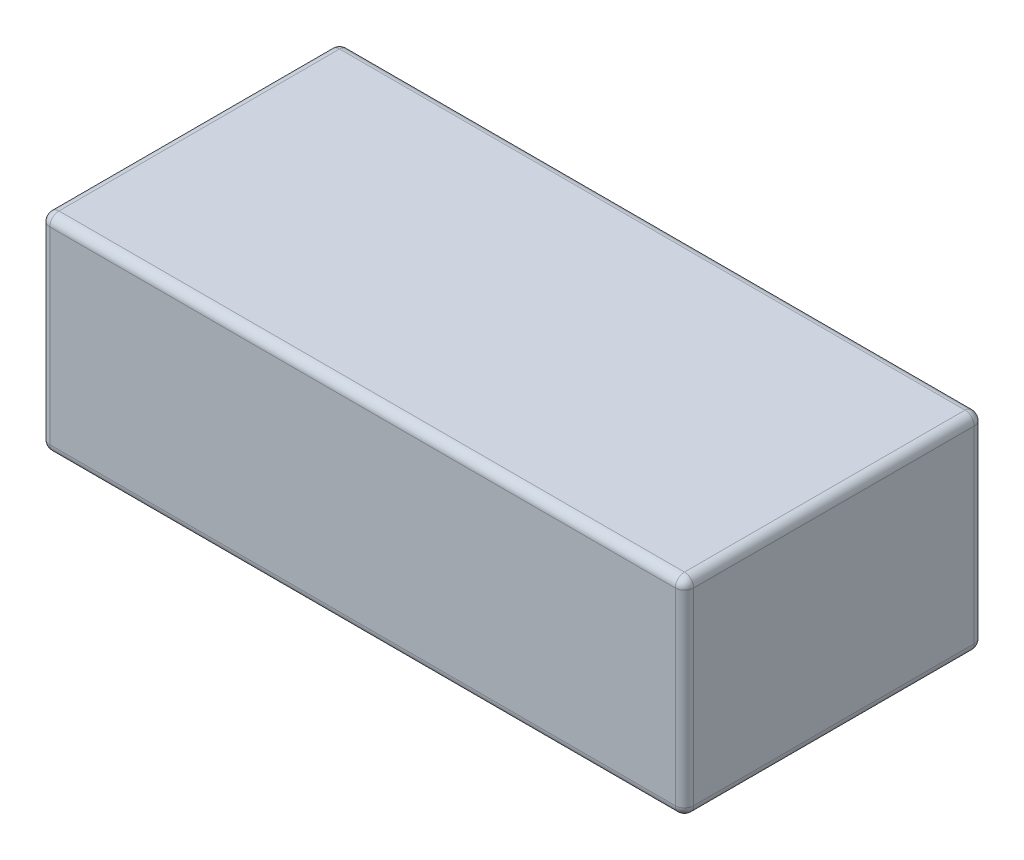
ISO-10303-21;
HEADER;
FILE_DESCRIPTION(('STEP AP214'),'2;1');
FILE_NAME('part.step','',(''),(''),'','','');
FILE_SCHEMA(('AUTOMOTIVE_DESIGN { 1 0 10303 214 1 1 1 1 }'));
ENDSEC;
DATA;
#1=APPLICATION_CONTEXT('core data for automotive mechanical design processes');
#2=APPLICATION_PROTOCOL_DEFINITION('international standard','automotive_design',2000,#1);
#3=PRODUCT_CONTEXT('',#1,'mechanical');
#4=PRODUCT('Part','Part','',(#3));
#5=PRODUCT_RELATED_PRODUCT_CATEGORY('part','',(#4));
#6=PRODUCT_DEFINITION_FORMATION('','',#4);
#7=PRODUCT_DEFINITION_CONTEXT('part definition',#1,'design');
#8=PRODUCT_DEFINITION('design','',#6,#7);
#9=PRODUCT_DEFINITION_SHAPE('','',#8);
#10=(LENGTH_UNIT() NAMED_UNIT(*) SI_UNIT(.MILLI.,.METRE.));
#11=(NAMED_UNIT(*) PLANE_ANGLE_UNIT() SI_UNIT($,.RADIAN.));
#12=(NAMED_UNIT(*) SI_UNIT($,.STERADIAN.) SOLID_ANGLE_UNIT());
#13=UNCERTAINTY_MEASURE_WITH_UNIT(LENGTH_MEASURE(1.E-05),#10,'distance_accuracy_value','');
#14=(GEOMETRIC_REPRESENTATION_CONTEXT(3) GLOBAL_UNCERTAINTY_ASSIGNED_CONTEXT((#13)) GLOBAL_UNIT_ASSIGNED_CONTEXT((#10,
#11,#12)) REPRESENTATION_CONTEXT('',''));
#15=CARTESIAN_POINT('',(0.,0.,0.));
#16=DIRECTION('',(0.,0.,1.));
#17=DIRECTION('',(1.,0.,0.));
#18=AXIS2_PLACEMENT_3D('',#15,#16,#17);
#19=CARTESIAN_POINT('',(70.,-22.5,32.5));
#20=DIRECTION('',(-1.,0.,0.));
#21=DIRECTION('',(0.,0.,1.));
#22=AXIS2_PLACEMENT_3D('',#19,#20,#21);
#23=PLANE('',#22);
#24=DIRECTION('',(0.,0.,-1.));
#25=VECTOR('',#24,1.);
#26=CARTESIAN_POINT('',(70.,-20.5,32.5));
#27=LINE('',#26,#25);
#28=CARTESIAN_POINT('',(70.,-20.5,30.5));
#29=VERTEX_POINT('',#28);
#30=CARTESIAN_POINT('',(70.,-20.5,-30.5));
#31=VERTEX_POINT('',#30);
#32=EDGE_CURVE('E185',#29,#31,#27,.T.);
#33=ORIENTED_EDGE('',*,*,#32,.T.);
#34=DIRECTION('',(0.,1.,0.));
#35=VECTOR('',#34,1.);
#36=CARTESIAN_POINT('',(70.,22.5,-30.5));
#37=LINE('',#36,#35);
#38=CARTESIAN_POINT('',(70.,20.5,-30.5));
#39=VERTEX_POINT('',#38);
#40=EDGE_CURVE('E188',#31,#39,#37,.T.);
#41=ORIENTED_EDGE('',*,*,#40,.T.);
#42=DIRECTION('',(0.,0.,-1.));
#43=VECTOR('',#42,1.);
#44=CARTESIAN_POINT('',(70.,20.5,32.5));
#45=LINE('',#44,#43);
#46=CARTESIAN_POINT('',(70.,20.5,30.5));
#47=VERTEX_POINT('',#46);
#48=EDGE_CURVE('E183',#39,#47,#45,.F.);
#49=ORIENTED_EDGE('',*,*,#48,.T.);
#50=DIRECTION('',(0.,1.,0.));
#51=VECTOR('',#50,1.);
#52=CARTESIAN_POINT('',(70.,-22.5,30.5));
#53=LINE('',#52,#51);
#54=EDGE_CURVE('E181',#47,#29,#53,.F.);
#55=ORIENTED_EDGE('',*,*,#54,.T.);
#56=EDGE_LOOP('',(#33,#41,#49,#55));
#57=FACE_BOUND('',#56,.T.);
#58=ADVANCED_FACE('F34',(#57),#23,.F.);
#59=CARTESIAN_POINT('',(-70.,22.5,32.5));
#60=DIRECTION('',(0.,-1.,0.));
#61=DIRECTION('',(0.,0.,-1.));
#62=AXIS2_PLACEMENT_3D('',#59,#60,#61);
#63=PLANE('',#62);
#64=DIRECTION('',(0.,0.,-1.));
#65=VECTOR('',#64,1.);
#66=CARTESIAN_POINT('',(68.,22.5,32.5));
#67=LINE('',#66,#65);
#68=CARTESIAN_POINT('',(68.,22.5,30.5));
#69=VERTEX_POINT('',#68);
#70=CARTESIAN_POINT('',(68.,22.5,-30.5));
#71=VERTEX_POINT('',#70);
#72=EDGE_CURVE('E167',#69,#71,#67,.T.);
#73=ORIENTED_EDGE('',*,*,#72,.T.);
#74=DIRECTION('',(-1.,0.,0.));
#75=VECTOR('',#74,1.);
#76=CARTESIAN_POINT('',(-70.,22.5,-30.5));
#77=LINE('',#76,#75);
#78=CARTESIAN_POINT('',(-68.,22.5,-30.5));
#79=VERTEX_POINT('',#78);
#80=EDGE_CURVE('E172',#71,#79,#77,.T.);
#81=ORIENTED_EDGE('',*,*,#80,.T.);
#82=DIRECTION('',(0.,0.,-1.));
#83=VECTOR('',#82,1.);
#84=CARTESIAN_POINT('',(-68.,22.5,32.5));
#85=LINE('',#84,#83);
#86=CARTESIAN_POINT('',(-68.,22.5,30.5));
#87=VERTEX_POINT('',#86);
#88=EDGE_CURVE('E169',#79,#87,#85,.F.);
#89=ORIENTED_EDGE('',*,*,#88,.T.);
#90=DIRECTION('',(-1.,0.,0.));
#91=VECTOR('',#90,1.);
#92=CARTESIAN_POINT('',(-70.,22.5,30.5));
#93=LINE('',#92,#91);
#94=EDGE_CURVE('E165',#87,#69,#93,.F.);
#95=ORIENTED_EDGE('',*,*,#94,.T.);
#96=EDGE_LOOP('',(#73,#81,#89,#95));
#97=FACE_BOUND('',#96,.T.);
#98=ADVANCED_FACE('F306',(#97),#63,.F.);
#99=CARTESIAN_POINT('',(-70.,-22.5,32.5));
#100=DIRECTION('',(1.,0.,0.));
#101=DIRECTION('',(0.,0.,-1.));
#102=AXIS2_PLACEMENT_3D('',#99,#100,#101);
#103=PLANE('',#102);
#104=DIRECTION('',(0.,0.,-1.));
#105=VECTOR('',#104,1.);
#106=CARTESIAN_POINT('',(-70.,20.5,32.5));
#107=LINE('',#106,#105);
#108=CARTESIAN_POINT('',(-70.,20.5,30.5));
#109=VERTEX_POINT('',#108);
#110=CARTESIAN_POINT('',(-70.,20.5,-30.5));
#111=VERTEX_POINT('',#110);
#112=EDGE_CURVE('E133',#109,#111,#107,.T.);
#113=ORIENTED_EDGE('',*,*,#112,.T.);
#114=DIRECTION('',(0.,-1.,0.));
#115=VECTOR('',#114,1.);
#116=CARTESIAN_POINT('',(-70.,-22.5,-30.5));
#117=LINE('',#116,#115);
#118=CARTESIAN_POINT('',(-70.,-20.5,-30.5));
#119=VERTEX_POINT('',#118);
#120=EDGE_CURVE('E129',#111,#119,#117,.T.);
#121=ORIENTED_EDGE('',*,*,#120,.T.);
#122=DIRECTION('',(0.,0.,-1.));
#123=VECTOR('',#122,1.);
#124=CARTESIAN_POINT('',(-70.,-20.5,32.5));
#125=LINE('',#124,#123);
#126=CARTESIAN_POINT('',(-70.,-20.5,30.5));
#127=VERTEX_POINT('',#126);
#128=EDGE_CURVE('E121',#119,#127,#125,.F.);
#129=ORIENTED_EDGE('',*,*,#128,.T.);
#130=DIRECTION('',(0.,-1.,0.));
#131=VECTOR('',#130,1.);
#132=CARTESIAN_POINT('',(-70.,-22.5,30.5));
#133=LINE('',#132,#131);
#134=EDGE_CURVE('E126',#127,#109,#133,.F.);
#135=ORIENTED_EDGE('',*,*,#134,.T.);
#136=EDGE_LOOP('',(#113,#121,#129,#135));
#137=FACE_BOUND('',#136,.T.);
#138=ADVANCED_FACE('F124',(#137),#103,.F.);
#139=CARTESIAN_POINT('',(-70.,-22.5,32.5));
#140=DIRECTION('',(0.,1.,0.));
#141=DIRECTION('',(0.,0.,1.));
#142=AXIS2_PLACEMENT_3D('',#139,#140,#141);
#143=PLANE('',#142);
#144=DIRECTION('',(0.,0.,-1.));
#145=VECTOR('',#144,1.);
#146=CARTESIAN_POINT('',(-68.,-22.5,32.5));
#147=LINE('',#146,#145);
#148=CARTESIAN_POINT('',(-68.,-22.5,30.5));
#149=VERTEX_POINT('',#148);
#150=CARTESIAN_POINT('',(-68.,-22.5,-30.5));
#151=VERTEX_POINT('',#150);
#152=EDGE_CURVE('E141',#149,#151,#147,.T.);
#153=ORIENTED_EDGE('',*,*,#152,.T.);
#154=DIRECTION('',(1.,0.,0.));
#155=VECTOR('',#154,1.);
#156=CARTESIAN_POINT('',(70.,-22.5,-30.5));
#157=LINE('',#156,#155);
#158=CARTESIAN_POINT('',(68.,-22.5,-30.5));
#159=VERTEX_POINT('',#158);
#160=EDGE_CURVE('E179',#151,#159,#157,.T.);
#161=ORIENTED_EDGE('',*,*,#160,.T.);
#162=DIRECTION('',(0.,0.,-1.));
#163=VECTOR('',#162,1.);
#164=CARTESIAN_POINT('',(68.,-22.5,32.5));
#165=LINE('',#164,#163);
#166=CARTESIAN_POINT('',(68.,-22.5,30.5));
#167=VERTEX_POINT('',#166);
#168=EDGE_CURVE('E176',#159,#167,#165,.F.);
#169=ORIENTED_EDGE('',*,*,#168,.T.);
#170=DIRECTION('',(1.,0.,0.));
#171=VECTOR('',#170,1.);
#172=CARTESIAN_POINT('',(-70.,-22.5,30.5));
#173=LINE('',#172,#171);
#174=EDGE_CURVE('E174',#167,#149,#173,.F.);
#175=ORIENTED_EDGE('',*,*,#174,.T.);
#176=EDGE_LOOP('',(#153,#161,#169,#175));
#177=FACE_BOUND('',#176,.T.);
#178=ADVANCED_FACE('F297',(#177),#143,.F.);
#179=CARTESIAN_POINT('',(0.,0.,32.5));
#180=DIRECTION('',(0.,0.,-1.));
#181=DIRECTION('',(-1.,0.,0.));
#182=AXIS2_PLACEMENT_3D('',#179,#180,#181);
#183=PLANE('',#182);
#184=DIRECTION('',(0.,-1.,0.));
#185=VECTOR('',#184,1.);
#186=CARTESIAN_POINT('',(-68.,0.,32.5));
#187=LINE('',#186,#185);
#188=CARTESIAN_POINT('',(-68.,20.5,32.5));
#189=VERTEX_POINT('',#188);
#190=CARTESIAN_POINT('',(-68.,-20.5,32.5));
#191=VERTEX_POINT('',#190);
#192=EDGE_CURVE('E43',#189,#191,#187,.T.);
#193=ORIENTED_EDGE('',*,*,#192,.T.);
#194=DIRECTION('',(1.,0.,0.));
#195=VECTOR('',#194,1.);
#196=CARTESIAN_POINT('',(0.,-20.5,32.5));
#197=LINE('',#196,#195);
#198=CARTESIAN_POINT('',(68.,-20.5,32.5));
#199=VERTEX_POINT('',#198);
#200=EDGE_CURVE('E11',#191,#199,#197,.T.);
#201=ORIENTED_EDGE('',*,*,#200,.T.);
#202=DIRECTION('',(0.,1.,0.));
#203=VECTOR('',#202,1.);
#204=CARTESIAN_POINT('',(68.,0.,32.5));
#205=LINE('',#204,#203);
#206=CARTESIAN_POINT('',(68.,20.5,32.5));
#207=VERTEX_POINT('',#206);
#208=EDGE_CURVE('E199',#199,#207,#205,.T.);
#209=ORIENTED_EDGE('',*,*,#208,.T.);
#210=DIRECTION('',(-1.,0.,0.));
#211=VECTOR('',#210,1.);
#212=CARTESIAN_POINT('',(0.,20.5,32.5));
#213=LINE('',#212,#211);
#214=EDGE_CURVE('E54',#207,#189,#213,.T.);
#215=ORIENTED_EDGE('',*,*,#214,.T.);
#216=EDGE_LOOP('',(#193,#201,#209,#215));
#217=FACE_BOUND('',#216,.T.);
#218=ADVANCED_FACE('F299',(#217),#183,.F.);
#219=CARTESIAN_POINT('',(0.,0.,-32.5));
#220=DIRECTION('',(0.,0.,-1.));
#221=DIRECTION('',(-1.,0.,0.));
#222=AXIS2_PLACEMENT_3D('',#219,#220,#221);
#223=PLANE('',#222);
#224=DIRECTION('',(0.,-1.,0.));
#225=VECTOR('',#224,1.);
#226=CARTESIAN_POINT('',(-68.,22.5,-32.5));
#227=LINE('',#226,#225);
#228=CARTESIAN_POINT('',(-68.,-20.5,-32.5));
#229=VERTEX_POINT('',#228);
#230=CARTESIAN_POINT('',(-68.,20.5,-32.5));
#231=VERTEX_POINT('',#230);
#232=EDGE_CURVE('E194',#229,#231,#227,.F.);
#233=ORIENTED_EDGE('',*,*,#232,.T.);
#234=DIRECTION('',(-1.,0.,0.));
#235=VECTOR('',#234,1.);
#236=CARTESIAN_POINT('',(70.,20.5,-32.5));
#237=LINE('',#236,#235);
#238=CARTESIAN_POINT('',(68.,20.5,-32.5));
#239=VERTEX_POINT('',#238);
#240=EDGE_CURVE('E196',#231,#239,#237,.F.);
#241=ORIENTED_EDGE('',*,*,#240,.T.);
#242=DIRECTION('',(0.,1.,0.));
#243=VECTOR('',#242,1.);
#244=CARTESIAN_POINT('',(68.,-22.5,-32.5));
#245=LINE('',#244,#243);
#246=CARTESIAN_POINT('',(68.,-20.5,-32.5));
#247=VERTEX_POINT('',#246);
#248=EDGE_CURVE('E190',#239,#247,#245,.F.);
#249=ORIENTED_EDGE('',*,*,#248,.T.);
#250=DIRECTION('',(1.,0.,0.));
#251=VECTOR('',#250,1.);
#252=CARTESIAN_POINT('',(-70.,-20.5,-32.5));
#253=LINE('',#252,#251);
#254=EDGE_CURVE('E192',#247,#229,#253,.F.);
#255=ORIENTED_EDGE('',*,*,#254,.T.);
#256=EDGE_LOOP('',(#233,#241,#249,#255));
#257=FACE_BOUND('',#256,.T.);
#258=ADVANCED_FACE('F266',(#257),#223,.T.);
#259=CARTESIAN_POINT('',(68.,-20.5,32.5));
#260=DIRECTION('',(0.,0.,-1.));
#261=DIRECTION('',(-1.,0.,0.));
#262=AXIS2_PLACEMENT_3D('',#259,#260,#261);
#263=CYLINDRICAL_SURFACE('',#262,2.);
#264=CARTESIAN_POINT('',(68.,-20.5,30.5));
#265=DIRECTION('',(0.,0.,1.));
#266=DIRECTION('',(1.,0.,0.));
#267=AXIS2_PLACEMENT_3D('',#264,#265,#266);
#268=CIRCLE('',#267,2.);
#269=EDGE_CURVE('E38',#167,#29,#268,.T.);
#270=ORIENTED_EDGE('',*,*,#269,.F.);
#271=ORIENTED_EDGE('',*,*,#168,.F.);
#272=CARTESIAN_POINT('',(68.,-20.5,-30.5));
#273=DIRECTION('',(0.,0.,-1.));
#274=DIRECTION('',(-1.,0.,0.));
#275=AXIS2_PLACEMENT_3D('',#272,#273,#274);
#276=CIRCLE('',#275,2.);
#277=EDGE_CURVE('E161',#31,#159,#276,.T.);
#278=ORIENTED_EDGE('',*,*,#277,.F.);
#279=ORIENTED_EDGE('',*,*,#32,.F.);
#280=EDGE_LOOP('',(#270,#271,#278,#279));
#281=FACE_BOUND('',#280,.T.);
#282=ADVANCED_FACE('F36',(#281),#263,.T.);
#283=CARTESIAN_POINT('',(68.,-20.5,30.5));
#284=DIRECTION('',(0.,0.,1.));
#285=DIRECTION('',(1.,0.,0.));
#286=AXIS2_PLACEMENT_3D('',#283,#284,#285);
#287=SPHERICAL_SURFACE('',#286,2.);
#288=CARTESIAN_POINT('',(68.,-20.5,30.5));
#289=DIRECTION('',(1.,0.,0.));
#290=DIRECTION('',(0.,0.,-1.));
#291=AXIS2_PLACEMENT_3D('',#288,#289,#290);
#292=CIRCLE('',#291,2.);
#293=EDGE_CURVE('E245',#167,#199,#292,.F.);
#294=ORIENTED_EDGE('',*,*,#293,.F.);
#295=ORIENTED_EDGE('',*,*,#269,.T.);
#296=CARTESIAN_POINT('',(68.,-20.5,30.5));
#297=DIRECTION('',(0.,-1.,0.));
#298=DIRECTION('',(0.,0.,-1.));
#299=AXIS2_PLACEMENT_3D('',#296,#297,#298);
#300=CIRCLE('',#299,2.);
#301=EDGE_CURVE('E248',#199,#29,#300,.F.);
#302=ORIENTED_EDGE('',*,*,#301,.F.);
#303=EDGE_LOOP('',(#294,#295,#302));
#304=FACE_BOUND('',#303,.T.);
#305=ADVANCED_FACE('F292',(#304),#287,.T.);
#306=CARTESIAN_POINT('',(68.,-20.5,-30.5));
#307=DIRECTION('',(0.,0.,1.));
#308=DIRECTION('',(1.,0.,0.));
#309=AXIS2_PLACEMENT_3D('',#306,#307,#308);
#310=SPHERICAL_SURFACE('',#309,2.);
#311=CARTESIAN_POINT('',(68.,-20.5,-30.5));
#312=DIRECTION('',(0.,-1.,0.));
#313=DIRECTION('',(0.,0.,-1.));
#314=AXIS2_PLACEMENT_3D('',#311,#312,#313);
#315=CIRCLE('',#314,2.);
#316=EDGE_CURVE('E239',#31,#247,#315,.F.);
#317=ORIENTED_EDGE('',*,*,#316,.F.);
#318=ORIENTED_EDGE('',*,*,#277,.T.);
#319=CARTESIAN_POINT('',(68.,-20.5,-30.5));
#320=DIRECTION('',(1.,0.,0.));
#321=DIRECTION('',(0.,0.,-1.));
#322=AXIS2_PLACEMENT_3D('',#319,#320,#321);
#323=CIRCLE('',#322,2.);
#324=EDGE_CURVE('E242',#247,#159,#323,.F.);
#325=ORIENTED_EDGE('',*,*,#324,.F.);
#326=EDGE_LOOP('',(#317,#318,#325));
#327=FACE_BOUND('',#326,.T.);
#328=ADVANCED_FACE('F255',(#327),#310,.T.);
#329=CARTESIAN_POINT('',(68.,0.,30.5));
#330=DIRECTION('',(0.,1.,0.));
#331=DIRECTION('',(0.,0.,1.));
#332=AXIS2_PLACEMENT_3D('',#329,#330,#331);
#333=CYLINDRICAL_SURFACE('',#332,2.);
#334=ORIENTED_EDGE('',*,*,#301,.T.);
#335=ORIENTED_EDGE('',*,*,#54,.F.);
#336=CARTESIAN_POINT('',(68.,20.5,30.5));
#337=DIRECTION('',(0.,1.,0.));
#338=DIRECTION('',(0.,0.,1.));
#339=AXIS2_PLACEMENT_3D('',#336,#337,#338);
#340=CIRCLE('',#339,2.);
#341=EDGE_CURVE('E233',#207,#47,#340,.T.);
#342=ORIENTED_EDGE('',*,*,#341,.F.);
#343=ORIENTED_EDGE('',*,*,#208,.F.);
#344=EDGE_LOOP('',(#334,#335,#342,#343));
#345=FACE_BOUND('',#344,.T.);
#346=ADVANCED_FACE('F287',(#345),#333,.T.);
#347=CARTESIAN_POINT('',(0.,-20.5,30.5));
#348=DIRECTION('',(1.,0.,0.));
#349=DIRECTION('',(0.,0.,-1.));
#350=AXIS2_PLACEMENT_3D('',#347,#348,#349);
#351=CYLINDRICAL_SURFACE('',#350,2.);
#352=ORIENTED_EDGE('',*,*,#293,.T.);
#353=ORIENTED_EDGE('',*,*,#200,.F.);
#354=CARTESIAN_POINT('',(-68.,-20.5,30.5));
#355=DIRECTION('',(-1.,0.,0.));
#356=DIRECTION('',(0.,0.,1.));
#357=AXIS2_PLACEMENT_3D('',#354,#355,#356);
#358=CIRCLE('',#357,2.);
#359=EDGE_CURVE('E145',#149,#191,#358,.T.);
#360=ORIENTED_EDGE('',*,*,#359,.F.);
#361=ORIENTED_EDGE('',*,*,#174,.F.);
#362=EDGE_LOOP('',(#352,#353,#360,#361));
#363=FACE_BOUND('',#362,.T.);
#364=ADVANCED_FACE('F295',(#363),#351,.T.);
#365=CARTESIAN_POINT('',(-68.,-20.5,32.5));
#366=DIRECTION('',(0.,0.,-1.));
#367=DIRECTION('',(-1.,0.,0.));
#368=AXIS2_PLACEMENT_3D('',#365,#366,#367);
#369=CYLINDRICAL_SURFACE('',#368,2.);
#370=CARTESIAN_POINT('',(-68.,-20.5,-30.5));
#371=DIRECTION('',(0.,0.,-1.));
#372=DIRECTION('',(-1.,0.,0.));
#373=AXIS2_PLACEMENT_3D('',#370,#371,#372);
#374=CIRCLE('',#373,2.);
#375=EDGE_CURVE('E146',#151,#119,#374,.T.);
#376=ORIENTED_EDGE('',*,*,#375,.F.);
#377=ORIENTED_EDGE('',*,*,#152,.F.);
#378=CARTESIAN_POINT('',(-68.,-20.5,30.5));
#379=DIRECTION('',(0.,0.,1.));
#380=DIRECTION('',(1.,0.,0.));
#381=AXIS2_PLACEMENT_3D('',#378,#379,#380);
#382=CIRCLE('',#381,2.);
#383=EDGE_CURVE('E137',#127,#149,#382,.T.);
#384=ORIENTED_EDGE('',*,*,#383,.F.);
#385=ORIENTED_EDGE('',*,*,#128,.F.);
#386=EDGE_LOOP('',(#376,#377,#384,#385));
#387=FACE_BOUND('',#386,.T.);
#388=ADVANCED_FACE('F139',(#387),#369,.T.);
#389=CARTESIAN_POINT('',(-70.,-20.5,-30.5));
#390=DIRECTION('',(-1.,0.,0.));
#391=DIRECTION('',(0.,0.,1.));
#392=AXIS2_PLACEMENT_3D('',#389,#390,#391);
#393=CYLINDRICAL_SURFACE('',#392,2.);
#394=ORIENTED_EDGE('',*,*,#324,.T.);
#395=ORIENTED_EDGE('',*,*,#160,.F.);
#396=CARTESIAN_POINT('',(-68.,-20.5,-30.5));
#397=DIRECTION('',(-1.,0.,0.));
#398=DIRECTION('',(0.,0.,1.));
#399=AXIS2_PLACEMENT_3D('',#396,#397,#398);
#400=CIRCLE('',#399,2.);
#401=EDGE_CURVE('E229',#229,#151,#400,.T.);
#402=ORIENTED_EDGE('',*,*,#401,.F.);
#403=ORIENTED_EDGE('',*,*,#254,.F.);
#404=EDGE_LOOP('',(#394,#395,#402,#403));
#405=FACE_BOUND('',#404,.T.);
#406=ADVANCED_FACE('F262',(#405),#393,.T.);
#407=CARTESIAN_POINT('',(68.,-22.5,-30.5));
#408=DIRECTION('',(0.,-1.,0.));
#409=DIRECTION('',(0.,0.,-1.));
#410=AXIS2_PLACEMENT_3D('',#407,#408,#409);
#411=CYLINDRICAL_SURFACE('',#410,2.);
#412=ORIENTED_EDGE('',*,*,#316,.T.);
#413=ORIENTED_EDGE('',*,*,#248,.F.);
#414=CARTESIAN_POINT('',(68.,20.5,-30.5));
#415=DIRECTION('',(0.,1.,0.));
#416=DIRECTION('',(0.,0.,1.));
#417=AXIS2_PLACEMENT_3D('',#414,#415,#416);
#418=CIRCLE('',#417,2.);
#419=EDGE_CURVE('E226',#39,#239,#418,.T.);
#420=ORIENTED_EDGE('',*,*,#419,.F.);
#421=ORIENTED_EDGE('',*,*,#40,.F.);
#422=EDGE_LOOP('',(#412,#413,#420,#421));
#423=FACE_BOUND('',#422,.T.);
#424=ADVANCED_FACE('F272',(#423),#411,.T.);
#425=CARTESIAN_POINT('',(68.,20.5,32.5));
#426=DIRECTION('',(0.,0.,-1.));
#427=DIRECTION('',(-1.,0.,0.));
#428=AXIS2_PLACEMENT_3D('',#425,#426,#427);
#429=CYLINDRICAL_SURFACE('',#428,2.);
#430=CARTESIAN_POINT('',(68.,20.5,30.5));
#431=DIRECTION('',(0.,0.,1.));
#432=DIRECTION('',(1.,0.,0.));
#433=AXIS2_PLACEMENT_3D('',#430,#431,#432);
#434=CIRCLE('',#433,2.);
#435=EDGE_CURVE('E236',#47,#69,#434,.T.);
#436=ORIENTED_EDGE('',*,*,#435,.F.);
#437=ORIENTED_EDGE('',*,*,#48,.F.);
#438=CARTESIAN_POINT('',(68.,20.5,-30.5));
#439=DIRECTION('',(0.,0.,-1.));
#440=DIRECTION('',(-1.,0.,0.));
#441=AXIS2_PLACEMENT_3D('',#438,#439,#440);
#442=CIRCLE('',#441,2.);
#443=EDGE_CURVE('E223',#71,#39,#442,.T.);
#444=ORIENTED_EDGE('',*,*,#443,.F.);
#445=ORIENTED_EDGE('',*,*,#72,.F.);
#446=EDGE_LOOP('',(#436,#437,#444,#445));
#447=FACE_BOUND('',#446,.T.);
#448=ADVANCED_FACE('F279',(#447),#429,.T.);
#449=CARTESIAN_POINT('',(68.,20.5,30.5));
#450=DIRECTION('',(0.,0.,1.));
#451=DIRECTION('',(1.,0.,0.));
#452=AXIS2_PLACEMENT_3D('',#449,#450,#451);
#453=SPHERICAL_SURFACE('',#452,2.);
#454=ORIENTED_EDGE('',*,*,#341,.T.);
#455=ORIENTED_EDGE('',*,*,#435,.T.);
#456=CARTESIAN_POINT('',(68.,20.5,30.5));
#457=DIRECTION('',(1.,0.,0.));
#458=DIRECTION('',(0.,0.,-1.));
#459=AXIS2_PLACEMENT_3D('',#456,#457,#458);
#460=CIRCLE('',#459,2.);
#461=EDGE_CURVE('E152',#207,#69,#460,.F.);
#462=ORIENTED_EDGE('',*,*,#461,.F.);
#463=EDGE_LOOP('',(#454,#455,#462));
#464=FACE_BOUND('',#463,.T.);
#465=ADVANCED_FACE('F285',(#464),#453,.T.);
#466=CARTESIAN_POINT('',(-68.,-20.5,30.5));
#467=DIRECTION('',(0.,0.,1.));
#468=DIRECTION('',(1.,0.,0.));
#469=AXIS2_PLACEMENT_3D('',#466,#467,#468);
#470=SPHERICAL_SURFACE('',#469,2.);
#471=ORIENTED_EDGE('',*,*,#383,.T.);
#472=ORIENTED_EDGE('',*,*,#359,.T.);
#473=CARTESIAN_POINT('',(-68.,-20.5,30.5));
#474=DIRECTION('',(0.,-1.,0.));
#475=DIRECTION('',(0.,0.,-1.));
#476=AXIS2_PLACEMENT_3D('',#473,#474,#475);
#477=CIRCLE('',#476,2.);
#478=EDGE_CURVE('E149',#127,#191,#477,.F.);
#479=ORIENTED_EDGE('',*,*,#478,.F.);
#480=EDGE_LOOP('',(#471,#472,#479));
#481=FACE_BOUND('',#480,.T.);
#482=ADVANCED_FACE('F150',(#481),#470,.T.);
#483=CARTESIAN_POINT('',(-68.,-20.5,-30.5));
#484=DIRECTION('',(0.,0.,1.));
#485=DIRECTION('',(1.,0.,0.));
#486=AXIS2_PLACEMENT_3D('',#483,#484,#485);
#487=SPHERICAL_SURFACE('',#486,2.);
#488=ORIENTED_EDGE('',*,*,#401,.T.);
#489=ORIENTED_EDGE('',*,*,#375,.T.);
#490=CARTESIAN_POINT('',(-68.,-20.5,-30.5));
#491=DIRECTION('',(0.,-1.,0.));
#492=DIRECTION('',(0.,0.,-1.));
#493=AXIS2_PLACEMENT_3D('',#490,#491,#492);
#494=CIRCLE('',#493,2.);
#495=EDGE_CURVE('E153',#229,#119,#494,.F.);
#496=ORIENTED_EDGE('',*,*,#495,.F.);
#497=EDGE_LOOP('',(#488,#489,#496));
#498=FACE_BOUND('',#497,.T.);
#499=ADVANCED_FACE('F346',(#498),#487,.T.);
#500=CARTESIAN_POINT('',(68.,20.5,-30.5));
#501=DIRECTION('',(0.,0.,1.));
#502=DIRECTION('',(1.,0.,0.));
#503=AXIS2_PLACEMENT_3D('',#500,#501,#502);
#504=SPHERICAL_SURFACE('',#503,2.);
#505=ORIENTED_EDGE('',*,*,#443,.T.);
#506=ORIENTED_EDGE('',*,*,#419,.T.);
#507=CARTESIAN_POINT('',(68.,20.5,-30.5));
#508=DIRECTION('',(1.,0.,0.));
#509=DIRECTION('',(0.,0.,-1.));
#510=AXIS2_PLACEMENT_3D('',#507,#508,#509);
#511=CIRCLE('',#510,2.);
#512=EDGE_CURVE('E217',#71,#239,#511,.F.);
#513=ORIENTED_EDGE('',*,*,#512,.F.);
#514=EDGE_LOOP('',(#505,#506,#513));
#515=FACE_BOUND('',#514,.T.);
#516=ADVANCED_FACE('F342',(#515),#504,.T.);
#517=CARTESIAN_POINT('',(0.,20.5,30.5));
#518=DIRECTION('',(-1.,0.,0.));
#519=DIRECTION('',(0.,0.,1.));
#520=AXIS2_PLACEMENT_3D('',#517,#518,#519);
#521=CYLINDRICAL_SURFACE('',#520,2.);
#522=ORIENTED_EDGE('',*,*,#461,.T.);
#523=ORIENTED_EDGE('',*,*,#94,.F.);
#524=CARTESIAN_POINT('',(-68.,20.5,30.5));
#525=DIRECTION('',(-1.,0.,0.));
#526=DIRECTION('',(0.,0.,1.));
#527=AXIS2_PLACEMENT_3D('',#524,#525,#526);
#528=CIRCLE('',#527,2.);
#529=EDGE_CURVE('E214',#189,#87,#528,.T.);
#530=ORIENTED_EDGE('',*,*,#529,.F.);
#531=ORIENTED_EDGE('',*,*,#214,.F.);
#532=EDGE_LOOP('',(#522,#523,#530,#531));
#533=FACE_BOUND('',#532,.T.);
#534=ADVANCED_FACE('F339',(#533),#521,.T.);
#535=CARTESIAN_POINT('',(-68.,0.,30.5));
#536=DIRECTION('',(0.,-1.,0.));
#537=DIRECTION('',(0.,0.,-1.));
#538=AXIS2_PLACEMENT_3D('',#535,#536,#537);
#539=CYLINDRICAL_SURFACE('',#538,2.);
#540=ORIENTED_EDGE('',*,*,#478,.T.);
#541=ORIENTED_EDGE('',*,*,#192,.F.);
#542=CARTESIAN_POINT('',(-68.,20.5,30.5));
#543=DIRECTION('',(0.,1.,0.));
#544=DIRECTION('',(0.,0.,1.));
#545=AXIS2_PLACEMENT_3D('',#542,#543,#544);
#546=CIRCLE('',#545,2.);
#547=EDGE_CURVE('E157',#109,#189,#546,.T.);
#548=ORIENTED_EDGE('',*,*,#547,.F.);
#549=ORIENTED_EDGE('',*,*,#134,.F.);
#550=EDGE_LOOP('',(#540,#541,#548,#549));
#551=FACE_BOUND('',#550,.T.);
#552=ADVANCED_FACE('F155',(#551),#539,.T.);
#553=CARTESIAN_POINT('',(-68.,-22.5,-30.5));
#554=DIRECTION('',(0.,1.,0.));
#555=DIRECTION('',(0.,0.,1.));
#556=AXIS2_PLACEMENT_3D('',#553,#554,#555);
#557=CYLINDRICAL_SURFACE('',#556,2.);
#558=ORIENTED_EDGE('',*,*,#495,.T.);
#559=ORIENTED_EDGE('',*,*,#120,.F.);
#560=CARTESIAN_POINT('',(-68.,20.5,-30.5));
#561=DIRECTION('',(0.,1.,0.));
#562=DIRECTION('',(-1.,0.,0.));
#563=AXIS2_PLACEMENT_3D('',#560,#561,#562);
#564=CIRCLE('',#563,2.);
#565=EDGE_CURVE('E210',#231,#111,#564,.T.);
#566=ORIENTED_EDGE('',*,*,#565,.F.);
#567=ORIENTED_EDGE('',*,*,#232,.F.);
#568=EDGE_LOOP('',(#558,#559,#566,#567));
#569=FACE_BOUND('',#568,.T.);
#570=ADVANCED_FACE('F332',(#569),#557,.T.);
#571=CARTESIAN_POINT('',(-70.,20.5,-30.5));
#572=DIRECTION('',(1.,0.,0.));
#573=DIRECTION('',(0.,0.,-1.));
#574=AXIS2_PLACEMENT_3D('',#571,#572,#573);
#575=CYLINDRICAL_SURFACE('',#574,2.);
#576=ORIENTED_EDGE('',*,*,#512,.T.);
#577=ORIENTED_EDGE('',*,*,#240,.F.);
#578=CARTESIAN_POINT('',(-68.,20.5,-30.5));
#579=DIRECTION('',(-1.,0.,0.));
#580=DIRECTION('',(0.,0.,1.));
#581=AXIS2_PLACEMENT_3D('',#578,#579,#580);
#582=CIRCLE('',#581,2.);
#583=EDGE_CURVE('E207',#79,#231,#582,.T.);
#584=ORIENTED_EDGE('',*,*,#583,.F.);
#585=ORIENTED_EDGE('',*,*,#80,.F.);
#586=EDGE_LOOP('',(#576,#577,#584,#585));
#587=FACE_BOUND('',#586,.T.);
#588=ADVANCED_FACE('F328',(#587),#575,.T.);
#589=CARTESIAN_POINT('',(-68.,20.5,30.5));
#590=DIRECTION('',(0.,0.,1.));
#591=DIRECTION('',(1.,0.,0.));
#592=AXIS2_PLACEMENT_3D('',#589,#590,#591);
#593=SPHERICAL_SURFACE('',#592,2.);
#594=ORIENTED_EDGE('',*,*,#547,.T.);
#595=ORIENTED_EDGE('',*,*,#529,.T.);
#596=CARTESIAN_POINT('',(-68.,20.5,30.5));
#597=DIRECTION('',(0.,0.,1.));
#598=DIRECTION('',(1.,0.,0.));
#599=AXIS2_PLACEMENT_3D('',#596,#597,#598);
#600=CIRCLE('',#599,2.);
#601=EDGE_CURVE('E205',#109,#87,#600,.F.);
#602=ORIENTED_EDGE('',*,*,#601,.F.);
#603=EDGE_LOOP('',(#594,#595,#602));
#604=FACE_BOUND('',#603,.T.);
#605=ADVANCED_FACE('F324',(#604),#593,.T.);
#606=CARTESIAN_POINT('',(-68.,20.5,-30.5));
#607=DIRECTION('',(0.,0.,1.));
#608=DIRECTION('',(1.,0.,0.));
#609=AXIS2_PLACEMENT_3D('',#606,#607,#608);
#610=SPHERICAL_SURFACE('',#609,2.);
#611=ORIENTED_EDGE('',*,*,#583,.T.);
#612=ORIENTED_EDGE('',*,*,#565,.T.);
#613=CARTESIAN_POINT('',(-68.,20.5,-30.5));
#614=DIRECTION('',(0.,0.,-1.));
#615=DIRECTION('',(-1.,0.,0.));
#616=AXIS2_PLACEMENT_3D('',#613,#614,#615);
#617=CIRCLE('',#616,2.);
#618=EDGE_CURVE('E203',#79,#111,#617,.F.);
#619=ORIENTED_EDGE('',*,*,#618,.F.);
#620=EDGE_LOOP('',(#611,#612,#619));
#621=FACE_BOUND('',#620,.T.);
#622=ADVANCED_FACE('F320',(#621),#610,.T.);
#623=CARTESIAN_POINT('',(-68.,20.5,32.5));
#624=DIRECTION('',(0.,0.,-1.));
#625=DIRECTION('',(-1.,0.,0.));
#626=AXIS2_PLACEMENT_3D('',#623,#624,#625);
#627=CYLINDRICAL_SURFACE('',#626,2.);
#628=ORIENTED_EDGE('',*,*,#601,.T.);
#629=ORIENTED_EDGE('',*,*,#88,.F.);
#630=ORIENTED_EDGE('',*,*,#618,.T.);
#631=ORIENTED_EDGE('',*,*,#112,.F.);
#632=EDGE_LOOP('',(#628,#629,#630,#631));
#633=FACE_BOUND('',#632,.T.);
#634=ADVANCED_FACE('F317',(#633),#627,.T.);
#635=CLOSED_SHELL('',(#58,#98,#138,#178,#218,#258,#282,#305,#328,#346,#364,#388,#406,#424,#448,
#465,#482,#499,#516,#534,#552,#570,#588,#605,#622,#634));
#636=MANIFOLD_SOLID_BREP('B2',#635);
#637=ADVANCED_BREP_SHAPE_REPRESENTATION('',(#18,#636),#14);
#638=SHAPE_DEFINITION_REPRESENTATION(#9,#637);
ENDSEC;
END-ISO-10303-21;
